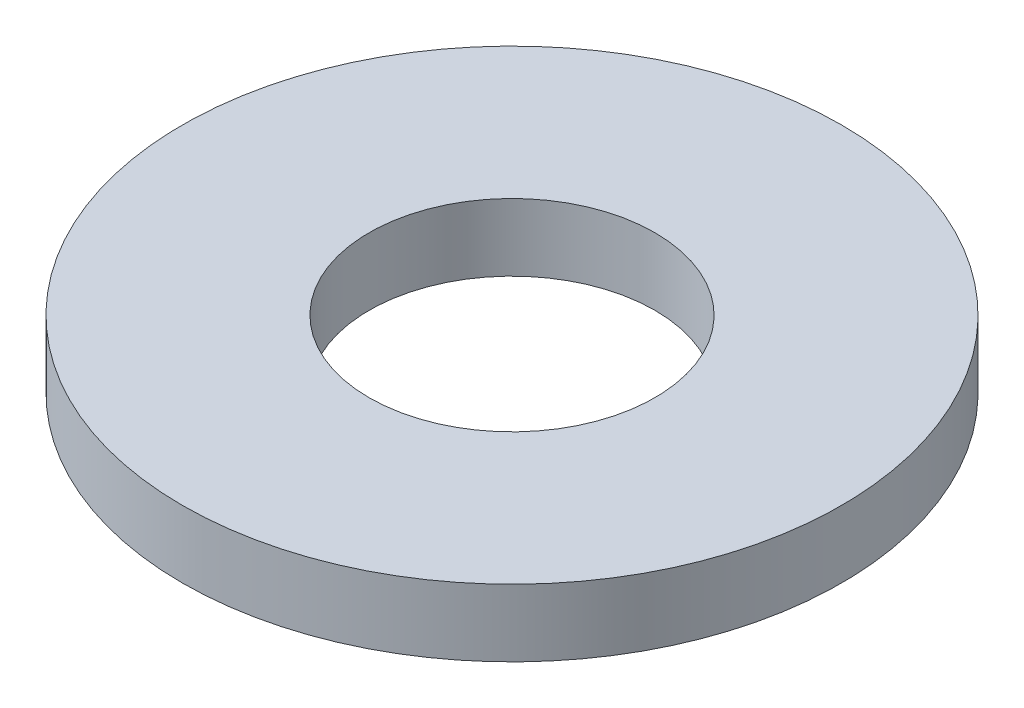
ISO-10303-21;
HEADER;
FILE_DESCRIPTION(('STEP AP214'),'2;1');
FILE_NAME('part.step','',(''),(''),'','','');
FILE_SCHEMA(('AUTOMOTIVE_DESIGN { 1 0 10303 214 1 1 1 1 }'));
ENDSEC;
DATA;
#1=APPLICATION_CONTEXT('core data for automotive mechanical design processes');
#2=APPLICATION_PROTOCOL_DEFINITION('international standard','automotive_design',2000,#1);
#3=PRODUCT_CONTEXT('',#1,'mechanical');
#4=PRODUCT('Part','Part','',(#3));
#5=PRODUCT_RELATED_PRODUCT_CATEGORY('part','',(#4));
#6=PRODUCT_DEFINITION_FORMATION('','',#4);
#7=PRODUCT_DEFINITION_CONTEXT('part definition',#1,'design');
#8=PRODUCT_DEFINITION('design','',#6,#7);
#9=PRODUCT_DEFINITION_SHAPE('','',#8);
#10=(LENGTH_UNIT() NAMED_UNIT(*) SI_UNIT(.MILLI.,.METRE.));
#11=(NAMED_UNIT(*) PLANE_ANGLE_UNIT() SI_UNIT($,.RADIAN.));
#12=(NAMED_UNIT(*) SI_UNIT($,.STERADIAN.) SOLID_ANGLE_UNIT());
#13=UNCERTAINTY_MEASURE_WITH_UNIT(LENGTH_MEASURE(1.E-05),#10,'distance_accuracy_value','');
#14=(GEOMETRIC_REPRESENTATION_CONTEXT(3) GLOBAL_UNCERTAINTY_ASSIGNED_CONTEXT((#13)) GLOBAL_UNIT_ASSIGNED_CONTEXT((#10,
#11,#12)) REPRESENTATION_CONTEXT('',''));
#15=CARTESIAN_POINT('',(0.,0.,0.));
#16=DIRECTION('',(0.,0.,1.));
#17=DIRECTION('',(1.,0.,0.));
#18=AXIS2_PLACEMENT_3D('',#15,#16,#17);
#19=CARTESIAN_POINT('',(0.,2.,0.));
#20=DIRECTION('',(0.,1.,0.));
#21=DIRECTION('',(0.,0.,1.));
#22=AXIS2_PLACEMENT_3D('',#19,#20,#21);
#23=PLANE('',#22);
#24=CARTESIAN_POINT('',(0.,2.,0.));
#25=DIRECTION('',(0.,1.,0.));
#26=DIRECTION('',(0.,0.,1.));
#27=AXIS2_PLACEMENT_3D('',#24,#25,#26);
#28=CIRCLE('',#27,9.8);
#29=CARTESIAN_POINT('',(0.,2.,9.8));
#30=VERTEX_POINT('',#29);
#31=EDGE_CURVE('E10',#30,#30,#28,.T.);
#32=ORIENTED_EDGE('',*,*,#31,.T.);
#33=EDGE_LOOP('',(#32));
#34=FACE_BOUND('',#33,.T.);
#35=CARTESIAN_POINT('',(0.,2.,0.));
#36=DIRECTION('',(0.,1.,0.));
#37=DIRECTION('',(0.,0.,1.));
#38=AXIS2_PLACEMENT_3D('',#35,#36,#37);
#39=CIRCLE('',#38,4.25);
#40=CARTESIAN_POINT('',(0.,2.,4.25));
#41=VERTEX_POINT('',#40);
#42=EDGE_CURVE('E50',#41,#41,#39,.T.);
#43=ORIENTED_EDGE('',*,*,#42,.F.);
#44=EDGE_LOOP('',(#43));
#45=FACE_BOUND('',#44,.T.);
#46=ADVANCED_FACE('F37',(#34,#45),#23,.T.);
#47=CARTESIAN_POINT('',(0.,0.,0.));
#48=DIRECTION('',(0.,1.,0.));
#49=DIRECTION('',(0.,0.,1.));
#50=AXIS2_PLACEMENT_3D('',#47,#48,#49);
#51=PLANE('',#50);
#52=CARTESIAN_POINT('',(0.,0.,0.));
#53=DIRECTION('',(0.,1.,0.));
#54=DIRECTION('',(0.,0.,1.));
#55=AXIS2_PLACEMENT_3D('',#52,#53,#54);
#56=CIRCLE('',#55,9.8);
#57=CARTESIAN_POINT('',(0.,0.,9.8));
#58=VERTEX_POINT('',#57);
#59=EDGE_CURVE('E41',#58,#58,#56,.T.);
#60=ORIENTED_EDGE('',*,*,#59,.F.);
#61=EDGE_LOOP('',(#60));
#62=FACE_BOUND('',#61,.T.);
#63=CARTESIAN_POINT('',(0.,0.,0.));
#64=DIRECTION('',(0.,1.,0.));
#65=DIRECTION('',(0.,0.,1.));
#66=AXIS2_PLACEMENT_3D('',#63,#64,#65);
#67=CIRCLE('',#66,4.25);
#68=CARTESIAN_POINT('',(0.,0.,4.25));
#69=VERTEX_POINT('',#68);
#70=EDGE_CURVE('E52',#69,#69,#67,.T.);
#71=ORIENTED_EDGE('',*,*,#70,.T.);
#72=EDGE_LOOP('',(#71));
#73=FACE_BOUND('',#72,.T.);
#74=ADVANCED_FACE('F64',(#62,#73),#51,.F.);
#75=CARTESIAN_POINT('',(0.,2.,0.));
#76=DIRECTION('',(0.,-1.,0.));
#77=DIRECTION('',(0.,0.,-1.));
#78=AXIS2_PLACEMENT_3D('',#75,#76,#77);
#79=CYLINDRICAL_SURFACE('',#78,9.8);
#80=ORIENTED_EDGE('',*,*,#31,.F.);
#81=EDGE_LOOP('',(#80));
#82=FACE_BOUND('',#81,.T.);
#83=ORIENTED_EDGE('',*,*,#59,.T.);
#84=EDGE_LOOP('',(#83));
#85=FACE_BOUND('',#84,.T.);
#86=ADVANCED_FACE('F39',(#82,#85),#79,.T.);
#87=CARTESIAN_POINT('',(0.,2.,0.));
#88=DIRECTION('',(0.,-1.,0.));
#89=DIRECTION('',(0.,0.,-1.));
#90=AXIS2_PLACEMENT_3D('',#87,#88,#89);
#91=CYLINDRICAL_SURFACE('',#90,4.25);
#92=ORIENTED_EDGE('',*,*,#42,.T.);
#93=EDGE_LOOP('',(#92));
#94=FACE_BOUND('',#93,.T.);
#95=ORIENTED_EDGE('',*,*,#70,.F.);
#96=EDGE_LOOP('',(#95));
#97=FACE_BOUND('',#96,.T.);
#98=ADVANCED_FACE('F60',(#94,#97),#91,.F.);
#99=CLOSED_SHELL('',(#46,#74,#86,#98));
#100=MANIFOLD_SOLID_BREP('B2',#99);
#101=ADVANCED_BREP_SHAPE_REPRESENTATION('',(#18,#100),#14);
#102=SHAPE_DEFINITION_REPRESENTATION(#9,#101);
ENDSEC;
END-ISO-10303-21;
